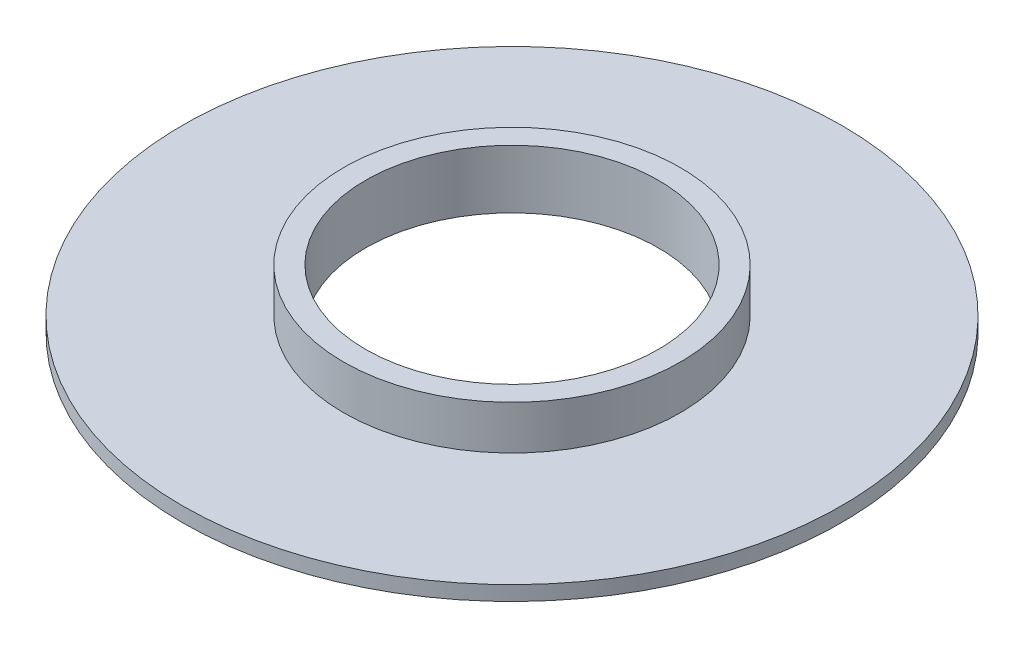
ISO-10303-21;
HEADER;
FILE_DESCRIPTION(('STEP AP214'),'2;1');
FILE_NAME('part.step','',(''),(''),'','','');
FILE_SCHEMA(('AUTOMOTIVE_DESIGN { 1 0 10303 214 1 1 1 1 }'));
ENDSEC;
DATA;
#1=APPLICATION_CONTEXT('core data for automotive mechanical design processes');
#2=APPLICATION_PROTOCOL_DEFINITION('international standard','automotive_design',2000,#1);
#3=PRODUCT_CONTEXT('',#1,'mechanical');
#4=PRODUCT('Part','Part','',(#3));
#5=PRODUCT_RELATED_PRODUCT_CATEGORY('part','',(#4));
#6=PRODUCT_DEFINITION_FORMATION('','',#4);
#7=PRODUCT_DEFINITION_CONTEXT('part definition',#1,'design');
#8=PRODUCT_DEFINITION('design','',#6,#7);
#9=PRODUCT_DEFINITION_SHAPE('','',#8);
#10=(LENGTH_UNIT() NAMED_UNIT(*) SI_UNIT(.MILLI.,.METRE.));
#11=(NAMED_UNIT(*) PLANE_ANGLE_UNIT() SI_UNIT($,.RADIAN.));
#12=(NAMED_UNIT(*) SI_UNIT($,.STERADIAN.) SOLID_ANGLE_UNIT());
#13=UNCERTAINTY_MEASURE_WITH_UNIT(LENGTH_MEASURE(1.E-05),#10,'distance_accuracy_value','');
#14=(GEOMETRIC_REPRESENTATION_CONTEXT(3) GLOBAL_UNCERTAINTY_ASSIGNED_CONTEXT((#13)) GLOBAL_UNIT_ASSIGNED_CONTEXT((#10,
#11,#12)) REPRESENTATION_CONTEXT('',''));
#15=CARTESIAN_POINT('',(0.,0.,0.));
#16=DIRECTION('',(0.,0.,1.));
#17=DIRECTION('',(1.,0.,0.));
#18=AXIS2_PLACEMENT_3D('',#15,#16,#17);
#19=CARTESIAN_POINT('',(0.,1.,0.));
#20=DIRECTION('',(0.,1.,0.));
#21=DIRECTION('',(0.,0.,1.));
#22=AXIS2_PLACEMENT_3D('',#19,#20,#21);
#23=PLANE('',#22);
#24=CARTESIAN_POINT('',(0.,1.,0.));
#25=DIRECTION('',(0.,1.,0.));
#26=DIRECTION('',(0.,0.,1.));
#27=AXIS2_PLACEMENT_3D('',#24,#25,#26);
#28=CIRCLE('',#27,22.5);
#29=CARTESIAN_POINT('',(0.,1.,22.5));
#30=VERTEX_POINT('',#29);
#31=EDGE_CURVE('E10',#30,#30,#28,.T.);
#32=ORIENTED_EDGE('',*,*,#31,.T.);
#33=EDGE_LOOP('',(#32));
#34=FACE_BOUND('',#33,.T.);
#35=CARTESIAN_POINT('',(0.,1.,0.));
#36=DIRECTION('',(0.,1.,0.));
#37=DIRECTION('',(0.,0.,1.));
#38=AXIS2_PLACEMENT_3D('',#35,#36,#37);
#39=CIRCLE('',#38,11.5);
#40=CARTESIAN_POINT('',(0.,1.,11.5));
#41=VERTEX_POINT('',#40);
#42=EDGE_CURVE('E47',#41,#41,#39,.T.);
#43=ORIENTED_EDGE('',*,*,#42,.F.);
#44=EDGE_LOOP('',(#43));
#45=FACE_BOUND('',#44,.T.);
#46=ADVANCED_FACE('F31',(#34,#45),#23,.T.);
#47=CARTESIAN_POINT('',(0.,0.,0.));
#48=DIRECTION('',(0.,1.,0.));
#49=DIRECTION('',(0.,0.,1.));
#50=AXIS2_PLACEMENT_3D('',#47,#48,#49);
#51=PLANE('',#50);
#52=CARTESIAN_POINT('',(0.,0.,0.));
#53=DIRECTION('',(0.,1.,0.));
#54=DIRECTION('',(0.,0.,1.));
#55=AXIS2_PLACEMENT_3D('',#52,#53,#54);
#56=CIRCLE('',#55,22.5);
#57=CARTESIAN_POINT('',(0.,0.,22.5));
#58=VERTEX_POINT('',#57);
#59=EDGE_CURVE('E35',#58,#58,#56,.T.);
#60=ORIENTED_EDGE('',*,*,#59,.F.);
#61=EDGE_LOOP('',(#60));
#62=FACE_BOUND('',#61,.T.);
#63=CARTESIAN_POINT('',(0.,0.,0.));
#64=DIRECTION('',(0.,1.,0.));
#65=DIRECTION('',(0.,0.,1.));
#66=AXIS2_PLACEMENT_3D('',#63,#64,#65);
#67=CIRCLE('',#66,10.);
#68=CARTESIAN_POINT('',(0.,0.,10.));
#69=VERTEX_POINT('',#68);
#70=EDGE_CURVE('E42',#69,#69,#67,.T.);
#71=ORIENTED_EDGE('',*,*,#70,.T.);
#72=EDGE_LOOP('',(#71));
#73=FACE_BOUND('',#72,.T.);
#74=ADVANCED_FACE('F71',(#62,#73),#51,.F.);
#75=CARTESIAN_POINT('',(0.,1.,0.));
#76=DIRECTION('',(0.,-1.,0.));
#77=DIRECTION('',(0.,0.,-1.));
#78=AXIS2_PLACEMENT_3D('',#75,#76,#77);
#79=CYLINDRICAL_SURFACE('',#78,22.5);
#80=ORIENTED_EDGE('',*,*,#31,.F.);
#81=EDGE_LOOP('',(#80));
#82=FACE_BOUND('',#81,.T.);
#83=ORIENTED_EDGE('',*,*,#59,.T.);
#84=EDGE_LOOP('',(#83));
#85=FACE_BOUND('',#84,.T.);
#86=ADVANCED_FACE('F33',(#82,#85),#79,.T.);
#87=CARTESIAN_POINT('',(0.,1.,0.));
#88=DIRECTION('',(0.,-1.,0.));
#89=DIRECTION('',(0.,0.,-1.));
#90=AXIS2_PLACEMENT_3D('',#87,#88,#89);
#91=CYLINDRICAL_SURFACE('',#90,10.);
#92=ORIENTED_EDGE('',*,*,#70,.F.);
#93=EDGE_LOOP('',(#92));
#94=FACE_BOUND('',#93,.T.);
#95=CARTESIAN_POINT('',(0.,4.,0.));
#96=DIRECTION('',(0.,1.,0.));
#97=DIRECTION('',(0.,0.,1.));
#98=AXIS2_PLACEMENT_3D('',#95,#96,#97);
#99=CIRCLE('',#98,10.);
#100=CARTESIAN_POINT('',(0.,4.,10.));
#101=VERTEX_POINT('',#100);
#102=EDGE_CURVE('E50',#101,#101,#99,.T.);
#103=ORIENTED_EDGE('',*,*,#102,.T.);
#104=EDGE_LOOP('',(#103));
#105=FACE_BOUND('',#104,.T.);
#106=ADVANCED_FACE('F56',(#94,#105),#91,.F.);
#107=CARTESIAN_POINT('',(0.,4.,0.));
#108=DIRECTION('',(0.,-1.,0.));
#109=DIRECTION('',(0.,0.,-1.));
#110=AXIS2_PLACEMENT_3D('',#107,#108,#109);
#111=CYLINDRICAL_SURFACE('',#110,11.5);
#112=CARTESIAN_POINT('',(0.,4.,0.));
#113=DIRECTION('',(0.,1.,0.));
#114=DIRECTION('',(0.,0.,1.));
#115=AXIS2_PLACEMENT_3D('',#112,#113,#114);
#116=CIRCLE('',#115,11.5);
#117=CARTESIAN_POINT('',(0.,4.,11.5));
#118=VERTEX_POINT('',#117);
#119=EDGE_CURVE('E46',#118,#118,#116,.T.);
#120=ORIENTED_EDGE('',*,*,#119,.F.);
#121=EDGE_LOOP('',(#120));
#122=FACE_BOUND('',#121,.T.);
#123=ORIENTED_EDGE('',*,*,#42,.T.);
#124=EDGE_LOOP('',(#123));
#125=FACE_BOUND('',#124,.T.);
#126=ADVANCED_FACE('F61',(#122,#125),#111,.T.);
#127=CARTESIAN_POINT('',(0.,4.,0.));
#128=DIRECTION('',(0.,1.,0.));
#129=DIRECTION('',(0.,0.,1.));
#130=AXIS2_PLACEMENT_3D('',#127,#128,#129);
#131=PLANE('',#130);
#132=ORIENTED_EDGE('',*,*,#102,.F.);
#133=EDGE_LOOP('',(#132));
#134=FACE_BOUND('',#133,.T.);
#135=ORIENTED_EDGE('',*,*,#119,.T.);
#136=EDGE_LOOP('',(#135));
#137=FACE_BOUND('',#136,.T.);
#138=ADVANCED_FACE('F58',(#134,#137),#131,.T.);
#139=CLOSED_SHELL('',(#46,#74,#86,#106,#126,#138));
#140=MANIFOLD_SOLID_BREP('B2',#139);
#141=ADVANCED_BREP_SHAPE_REPRESENTATION('',(#18,#140),#14);
#142=SHAPE_DEFINITION_REPRESENTATION(#9,#141);
ENDSEC;
END-ISO-10303-21;
